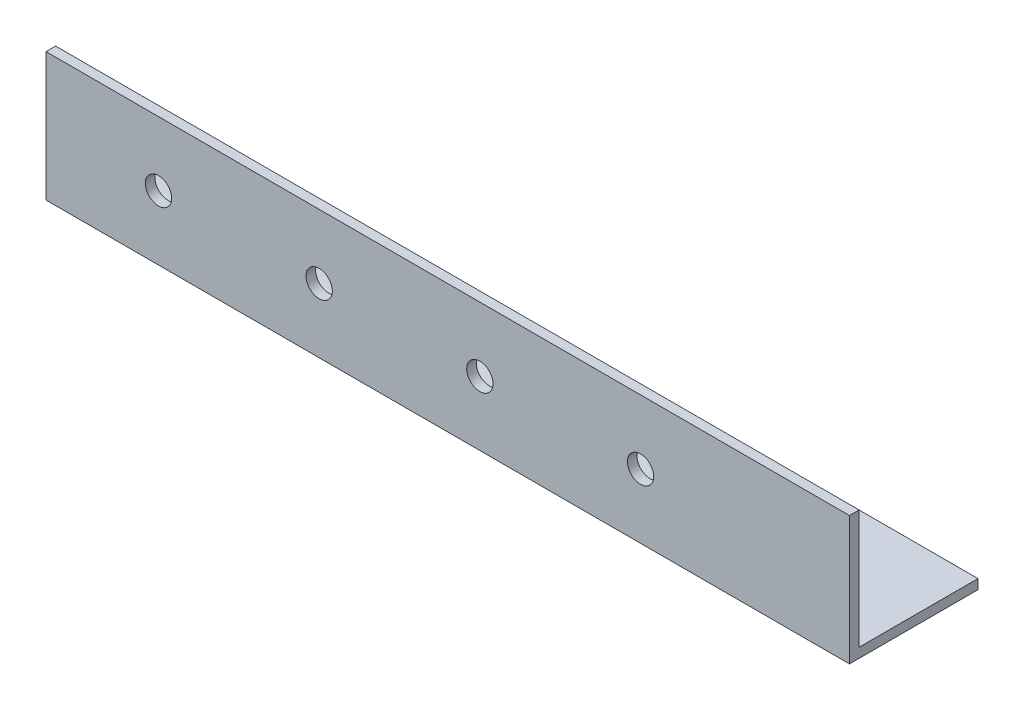
ISO-10303-21;
HEADER;
FILE_DESCRIPTION(('STEP AP214'),'2;1');
FILE_NAME('part.step','',(''),(''),'','','');
FILE_SCHEMA(('AUTOMOTIVE_DESIGN { 1 0 10303 214 1 1 1 1 }'));
ENDSEC;
DATA;
#1=APPLICATION_CONTEXT('core data for automotive mechanical design processes');
#2=APPLICATION_PROTOCOL_DEFINITION('international standard','automotive_design',2000,#1);
#3=PRODUCT_CONTEXT('',#1,'mechanical');
#4=PRODUCT('Part','Part','',(#3));
#5=PRODUCT_RELATED_PRODUCT_CATEGORY('part','',(#4));
#6=PRODUCT_DEFINITION_FORMATION('','',#4);
#7=PRODUCT_DEFINITION_CONTEXT('part definition',#1,'design');
#8=PRODUCT_DEFINITION('design','',#6,#7);
#9=PRODUCT_DEFINITION_SHAPE('','',#8);
#10=(LENGTH_UNIT() NAMED_UNIT(*) SI_UNIT(.MILLI.,.METRE.));
#11=(NAMED_UNIT(*) PLANE_ANGLE_UNIT() SI_UNIT($,.RADIAN.));
#12=(NAMED_UNIT(*) SI_UNIT($,.STERADIAN.) SOLID_ANGLE_UNIT());
#13=UNCERTAINTY_MEASURE_WITH_UNIT(LENGTH_MEASURE(1.E-05),#10,'distance_accuracy_value','');
#14=(GEOMETRIC_REPRESENTATION_CONTEXT(3) GLOBAL_UNCERTAINTY_ASSIGNED_CONTEXT((#13)) GLOBAL_UNIT_ASSIGNED_CONTEXT((#10,
#11,#12)) REPRESENTATION_CONTEXT('',''));
#15=CARTESIAN_POINT('',(0.,0.,0.));
#16=DIRECTION('',(0.,0.,1.));
#17=DIRECTION('',(1.,0.,0.));
#18=AXIS2_PLACEMENT_3D('',#15,#16,#17);
#19=CARTESIAN_POINT('',(250.,0.,0.));
#20=DIRECTION('',(0.,1.,0.));
#21=DIRECTION('',(0.,0.,1.));
#22=AXIS2_PLACEMENT_3D('',#19,#20,#21);
#23=PLANE('',#22);
#24=DIRECTION('',(0.,0.,-1.));
#25=VECTOR('',#24,1.);
#26=CARTESIAN_POINT('',(0.,0.,0.));
#27=LINE('',#26,#25);
#28=CARTESIAN_POINT('',(0.,0.,0.));
#29=VERTEX_POINT('',#28);
#30=CARTESIAN_POINT('',(0.,0.,-40.));
#31=VERTEX_POINT('',#30);
#32=EDGE_CURVE('E118',#29,#31,#27,.T.);
#33=ORIENTED_EDGE('',*,*,#32,.T.);
#34=DIRECTION('',(-1.,0.,0.));
#35=VECTOR('',#34,1.);
#36=CARTESIAN_POINT('',(250.,0.,-40.));
#37=LINE('',#36,#35);
#38=CARTESIAN_POINT('',(250.,0.,-40.));
#39=VERTEX_POINT('',#38);
#40=EDGE_CURVE('E11',#39,#31,#37,.T.);
#41=ORIENTED_EDGE('',*,*,#40,.F.);
#42=DIRECTION('',(0.,0.,-1.));
#43=VECTOR('',#42,1.);
#44=CARTESIAN_POINT('',(250.,0.,0.));
#45=LINE('',#44,#43);
#46=CARTESIAN_POINT('',(250.,0.,0.));
#47=VERTEX_POINT('',#46);
#48=EDGE_CURVE('E83',#47,#39,#45,.T.);
#49=ORIENTED_EDGE('',*,*,#48,.F.);
#50=DIRECTION('',(-1.,0.,0.));
#51=VECTOR('',#50,1.);
#52=CARTESIAN_POINT('',(250.,0.,0.));
#53=LINE('',#52,#51);
#54=EDGE_CURVE('E114',#47,#29,#53,.T.);
#55=ORIENTED_EDGE('',*,*,#54,.T.);
#56=EDGE_LOOP('',(#33,#41,#49,#55));
#57=FACE_BOUND('',#56,.T.);
#58=ADVANCED_FACE('F37',(#57),#23,.F.);
#59=CARTESIAN_POINT('',(250.,3.,-40.));
#60=DIRECTION('',(0.,0.,-1.));
#61=DIRECTION('',(-1.,0.,0.));
#62=AXIS2_PLACEMENT_3D('',#59,#60,#61);
#63=PLANE('',#62);
#64=DIRECTION('',(0.,-1.,0.));
#65=VECTOR('',#64,1.);
#66=CARTESIAN_POINT('',(0.,3.,-40.));
#67=LINE('',#66,#65);
#68=CARTESIAN_POINT('',(0.,3.,-40.));
#69=VERTEX_POINT('',#68);
#70=EDGE_CURVE('E121',#69,#31,#67,.T.);
#71=ORIENTED_EDGE('',*,*,#70,.F.);
#72=DIRECTION('',(-1.,0.,0.));
#73=VECTOR('',#72,1.);
#74=CARTESIAN_POINT('',(250.,3.,-40.));
#75=LINE('',#74,#73);
#76=CARTESIAN_POINT('',(250.,3.,-40.));
#77=VERTEX_POINT('',#76);
#78=EDGE_CURVE('E45',#77,#69,#75,.T.);
#79=ORIENTED_EDGE('',*,*,#78,.F.);
#80=DIRECTION('',(0.,-1.,0.));
#81=VECTOR('',#80,1.);
#82=CARTESIAN_POINT('',(250.,3.,-40.));
#83=LINE('',#82,#81);
#84=EDGE_CURVE('E201',#77,#39,#83,.T.);
#85=ORIENTED_EDGE('',*,*,#84,.T.);
#86=ORIENTED_EDGE('',*,*,#40,.T.);
#87=EDGE_LOOP('',(#71,#79,#85,#86));
#88=FACE_BOUND('',#87,.T.);
#89=ADVANCED_FACE('F140',(#88),#63,.T.);
#90=CARTESIAN_POINT('',(250.,3.,0.));
#91=DIRECTION('',(0.,1.,0.));
#92=DIRECTION('',(0.,0.,1.));
#93=AXIS2_PLACEMENT_3D('',#90,#91,#92);
#94=PLANE('',#93);
#95=DIRECTION('',(0.,0.,-1.));
#96=VECTOR('',#95,1.);
#97=CARTESIAN_POINT('',(0.,3.,0.));
#98=LINE('',#97,#96);
#99=CARTESIAN_POINT('',(0.,3.,-3.));
#100=VERTEX_POINT('',#99);
#101=EDGE_CURVE('E125',#100,#69,#98,.T.);
#102=ORIENTED_EDGE('',*,*,#101,.F.);
#103=DIRECTION('',(-1.,0.,0.));
#104=VECTOR('',#103,1.);
#105=CARTESIAN_POINT('',(250.,3.,-3.));
#106=LINE('',#105,#104);
#107=CARTESIAN_POINT('',(250.,3.,-3.));
#108=VERTEX_POINT('',#107);
#109=EDGE_CURVE('E104',#108,#100,#106,.T.);
#110=ORIENTED_EDGE('',*,*,#109,.F.);
#111=DIRECTION('',(0.,0.,-1.));
#112=VECTOR('',#111,1.);
#113=CARTESIAN_POINT('',(250.,3.,0.));
#114=LINE('',#113,#112);
#115=EDGE_CURVE('E110',#108,#77,#114,.T.);
#116=ORIENTED_EDGE('',*,*,#115,.T.);
#117=ORIENTED_EDGE('',*,*,#78,.T.);
#118=EDGE_LOOP('',(#102,#110,#116,#117));
#119=FACE_BOUND('',#118,.T.);
#120=ADVANCED_FACE('F137',(#119),#94,.T.);
#121=CARTESIAN_POINT('',(250.,0.,-3.));
#122=DIRECTION('',(0.,0.,-1.));
#123=DIRECTION('',(-1.,0.,0.));
#124=AXIS2_PLACEMENT_3D('',#121,#122,#123);
#125=PLANE('',#124);
#126=CARTESIAN_POINT('',(35.,20.0000000000001,-3.));
#127=DIRECTION('',(0.,0.,-1.));
#128=DIRECTION('',(-1.,0.,0.));
#129=AXIS2_PLACEMENT_3D('',#126,#127,#128);
#130=CIRCLE('',#129,4.1);
#131=CARTESIAN_POINT('',(30.9,20.0000000000001,-3.));
#132=VERTEX_POINT('',#131);
#133=EDGE_CURVE('E122',#132,#132,#130,.T.);
#134=ORIENTED_EDGE('',*,*,#133,.F.);
#135=EDGE_LOOP('',(#134));
#136=FACE_BOUND('',#135,.T.);
#137=CARTESIAN_POINT('',(85.,20.0000000000001,-3.));
#138=DIRECTION('',(0.,0.,-1.));
#139=DIRECTION('',(-1.,0.,0.));
#140=AXIS2_PLACEMENT_3D('',#137,#138,#139);
#141=CIRCLE('',#140,4.1);
#142=CARTESIAN_POINT('',(80.9,20.0000000000001,-3.));
#143=VERTEX_POINT('',#142);
#144=EDGE_CURVE('E179',#143,#143,#141,.T.);
#145=ORIENTED_EDGE('',*,*,#144,.F.);
#146=EDGE_LOOP('',(#145));
#147=FACE_BOUND('',#146,.T.);
#148=CARTESIAN_POINT('',(135.,20.0000000000001,-3.));
#149=DIRECTION('',(0.,0.,-1.));
#150=DIRECTION('',(-1.,0.,0.));
#151=AXIS2_PLACEMENT_3D('',#148,#149,#150);
#152=CIRCLE('',#151,4.09999999999999);
#153=CARTESIAN_POINT('',(130.9,20.0000000000001,-3.));
#154=VERTEX_POINT('',#153);
#155=EDGE_CURVE('E183',#154,#154,#152,.T.);
#156=ORIENTED_EDGE('',*,*,#155,.F.);
#157=EDGE_LOOP('',(#156));
#158=FACE_BOUND('',#157,.T.);
#159=CARTESIAN_POINT('',(185.,20.0000000000001,-3.));
#160=DIRECTION('',(0.,0.,-1.));
#161=DIRECTION('',(-1.,0.,0.));
#162=AXIS2_PLACEMENT_3D('',#159,#160,#161);
#163=CIRCLE('',#162,4.10000000000001);
#164=CARTESIAN_POINT('',(180.9,20.0000000000001,-3.));
#165=VERTEX_POINT('',#164);
#166=EDGE_CURVE('E186',#165,#165,#163,.T.);
#167=ORIENTED_EDGE('',*,*,#166,.F.);
#168=EDGE_LOOP('',(#167));
#169=FACE_BOUND('',#168,.T.);
#170=DIRECTION('',(0.,1.,0.));
#171=VECTOR('',#170,1.);
#172=CARTESIAN_POINT('',(0.,0.,-3.));
#173=LINE('',#172,#171);
#174=CARTESIAN_POINT('',(0.,40.,-3.));
#175=VERTEX_POINT('',#174);
#176=EDGE_CURVE('E99',#175,#100,#173,.F.);
#177=ORIENTED_EDGE('',*,*,#176,.F.);
#178=DIRECTION('',(-1.,0.,0.));
#179=VECTOR('',#178,1.);
#180=CARTESIAN_POINT('',(250.,40.,-3.));
#181=LINE('',#180,#179);
#182=CARTESIAN_POINT('',(250.,40.,-3.));
#183=VERTEX_POINT('',#182);
#184=EDGE_CURVE('E94',#183,#175,#181,.T.);
#185=ORIENTED_EDGE('',*,*,#184,.F.);
#186=DIRECTION('',(0.,1.,0.));
#187=VECTOR('',#186,1.);
#188=CARTESIAN_POINT('',(250.,0.,-3.));
#189=LINE('',#188,#187);
#190=EDGE_CURVE('E97',#183,#108,#189,.F.);
#191=ORIENTED_EDGE('',*,*,#190,.T.);
#192=ORIENTED_EDGE('',*,*,#109,.T.);
#193=EDGE_LOOP('',(#177,#185,#191,#192));
#194=FACE_BOUND('',#193,.T.);
#195=ADVANCED_FACE('F96',(#136,#147,#158,#169,#194),#125,.T.);
#196=CARTESIAN_POINT('',(250.,40.,0.));
#197=DIRECTION('',(0.,1.,0.));
#198=DIRECTION('',(0.,0.,1.));
#199=AXIS2_PLACEMENT_3D('',#196,#197,#198);
#200=PLANE('',#199);
#201=DIRECTION('',(0.,0.,-1.));
#202=VECTOR('',#201,1.);
#203=CARTESIAN_POINT('',(0.,40.,0.));
#204=LINE('',#203,#202);
#205=CARTESIAN_POINT('',(0.,40.,0.));
#206=VERTEX_POINT('',#205);
#207=EDGE_CURVE('E129',#206,#175,#204,.T.);
#208=ORIENTED_EDGE('',*,*,#207,.F.);
#209=DIRECTION('',(-1.,0.,0.));
#210=VECTOR('',#209,1.);
#211=CARTESIAN_POINT('',(250.,40.,0.));
#212=LINE('',#211,#210);
#213=CARTESIAN_POINT('',(250.,40.,0.));
#214=VERTEX_POINT('',#213);
#215=EDGE_CURVE('E74',#214,#206,#212,.T.);
#216=ORIENTED_EDGE('',*,*,#215,.F.);
#217=DIRECTION('',(0.,0.,-1.));
#218=VECTOR('',#217,1.);
#219=CARTESIAN_POINT('',(250.,40.,0.));
#220=LINE('',#219,#218);
#221=EDGE_CURVE('E108',#214,#183,#220,.T.);
#222=ORIENTED_EDGE('',*,*,#221,.T.);
#223=ORIENTED_EDGE('',*,*,#184,.T.);
#224=EDGE_LOOP('',(#208,#216,#222,#223));
#225=FACE_BOUND('',#224,.T.);
#226=ADVANCED_FACE('F112',(#225),#200,.T.);
#227=CARTESIAN_POINT('',(250.,0.,0.));
#228=DIRECTION('',(0.,0.,-1.));
#229=DIRECTION('',(-1.,0.,0.));
#230=AXIS2_PLACEMENT_3D('',#227,#228,#229);
#231=PLANE('',#230);
#232=CARTESIAN_POINT('',(35.,20.0000000000001,0.));
#233=DIRECTION('',(0.,0.,1.));
#234=DIRECTION('',(1.,0.,0.));
#235=AXIS2_PLACEMENT_3D('',#232,#233,#234);
#236=CIRCLE('',#235,4.1);
#237=CARTESIAN_POINT('',(39.1,20.0000000000001,0.));
#238=VERTEX_POINT('',#237);
#239=EDGE_CURVE('E188',#238,#238,#236,.T.);
#240=ORIENTED_EDGE('',*,*,#239,.F.);
#241=EDGE_LOOP('',(#240));
#242=FACE_BOUND('',#241,.T.);
#243=CARTESIAN_POINT('',(85.,20.0000000000001,0.));
#244=DIRECTION('',(0.,0.,1.));
#245=DIRECTION('',(1.,0.,0.));
#246=AXIS2_PLACEMENT_3D('',#243,#244,#245);
#247=CIRCLE('',#246,4.1);
#248=CARTESIAN_POINT('',(89.1,20.0000000000001,0.));
#249=VERTEX_POINT('',#248);
#250=EDGE_CURVE('E192',#249,#249,#247,.T.);
#251=ORIENTED_EDGE('',*,*,#250,.F.);
#252=EDGE_LOOP('',(#251));
#253=FACE_BOUND('',#252,.T.);
#254=CARTESIAN_POINT('',(135.,20.0000000000001,0.));
#255=DIRECTION('',(0.,0.,1.));
#256=DIRECTION('',(1.,0.,0.));
#257=AXIS2_PLACEMENT_3D('',#254,#255,#256);
#258=CIRCLE('',#257,4.09999999999999);
#259=CARTESIAN_POINT('',(139.1,20.0000000000001,0.));
#260=VERTEX_POINT('',#259);
#261=EDGE_CURVE('E309',#260,#260,#258,.T.);
#262=ORIENTED_EDGE('',*,*,#261,.F.);
#263=EDGE_LOOP('',(#262));
#264=FACE_BOUND('',#263,.T.);
#265=CARTESIAN_POINT('',(185.,20.0000000000001,0.));
#266=DIRECTION('',(0.,0.,1.));
#267=DIRECTION('',(1.,0.,0.));
#268=AXIS2_PLACEMENT_3D('',#265,#266,#267);
#269=CIRCLE('',#268,4.10000000000001);
#270=CARTESIAN_POINT('',(189.1,20.0000000000001,0.));
#271=VERTEX_POINT('',#270);
#272=EDGE_CURVE('E195',#271,#271,#269,.T.);
#273=ORIENTED_EDGE('',*,*,#272,.F.);
#274=EDGE_LOOP('',(#273));
#275=FACE_BOUND('',#274,.T.);
#276=DIRECTION('',(0.,-1.,0.));
#277=VECTOR('',#276,1.);
#278=CARTESIAN_POINT('',(0.,0.,0.));
#279=LINE('',#278,#277);
#280=EDGE_CURVE('E77',#206,#29,#279,.T.);
#281=ORIENTED_EDGE('',*,*,#280,.T.);
#282=ORIENTED_EDGE('',*,*,#54,.F.);
#283=DIRECTION('',(0.,-1.,0.));
#284=VECTOR('',#283,1.);
#285=CARTESIAN_POINT('',(250.,0.,0.));
#286=LINE('',#285,#284);
#287=EDGE_CURVE('E53',#214,#47,#286,.T.);
#288=ORIENTED_EDGE('',*,*,#287,.F.);
#289=ORIENTED_EDGE('',*,*,#215,.T.);
#290=EDGE_LOOP('',(#281,#282,#288,#289));
#291=FACE_BOUND('',#290,.T.);
#292=ADVANCED_FACE('F145',(#242,#253,#264,#275,#291),#231,.F.);
#293=CARTESIAN_POINT('',(250.,0.,0.));
#294=DIRECTION('',(-1.,0.,0.));
#295=DIRECTION('',(0.,0.,1.));
#296=AXIS2_PLACEMENT_3D('',#293,#294,#295);
#297=PLANE('',#296);
#298=ORIENTED_EDGE('',*,*,#48,.T.);
#299=ORIENTED_EDGE('',*,*,#84,.F.);
#300=ORIENTED_EDGE('',*,*,#115,.F.);
#301=ORIENTED_EDGE('',*,*,#190,.F.);
#302=ORIENTED_EDGE('',*,*,#221,.F.);
#303=ORIENTED_EDGE('',*,*,#287,.T.);
#304=EDGE_LOOP('',(#298,#299,#300,#301,#302,#303));
#305=FACE_BOUND('',#304,.T.);
#306=ADVANCED_FACE('F107',(#305),#297,.F.);
#307=CARTESIAN_POINT('',(0.,0.,0.));
#308=DIRECTION('',(-1.,0.,0.));
#309=DIRECTION('',(0.,0.,1.));
#310=AXIS2_PLACEMENT_3D('',#307,#308,#309);
#311=PLANE('',#310);
#312=ORIENTED_EDGE('',*,*,#32,.F.);
#313=ORIENTED_EDGE('',*,*,#280,.F.);
#314=ORIENTED_EDGE('',*,*,#207,.T.);
#315=ORIENTED_EDGE('',*,*,#176,.T.);
#316=ORIENTED_EDGE('',*,*,#101,.T.);
#317=ORIENTED_EDGE('',*,*,#70,.T.);
#318=EDGE_LOOP('',(#312,#313,#314,#315,#316,#317));
#319=FACE_BOUND('',#318,.T.);
#320=ADVANCED_FACE('F143',(#319),#311,.T.);
#321=CARTESIAN_POINT('',(185.,20.0000000000001,-10.));
#322=DIRECTION('',(0.,0.,1.));
#323=DIRECTION('',(1.,0.,0.));
#324=AXIS2_PLACEMENT_3D('',#321,#322,#323);
#325=CYLINDRICAL_SURFACE('',#324,4.10000000000001);
#326=ORIENTED_EDGE('',*,*,#166,.T.);
#327=EDGE_LOOP('',(#326));
#328=FACE_BOUND('',#327,.T.);
#329=ORIENTED_EDGE('',*,*,#272,.T.);
#330=EDGE_LOOP('',(#329));
#331=FACE_BOUND('',#330,.T.);
#332=ADVANCED_FACE('F217',(#328,#331),#325,.F.);
#333=CARTESIAN_POINT('',(135.,20.0000000000001,-10.));
#334=DIRECTION('',(0.,0.,1.));
#335=DIRECTION('',(1.,0.,0.));
#336=AXIS2_PLACEMENT_3D('',#333,#334,#335);
#337=CYLINDRICAL_SURFACE('',#336,4.09999999999999);
#338=ORIENTED_EDGE('',*,*,#155,.T.);
#339=EDGE_LOOP('',(#338));
#340=FACE_BOUND('',#339,.T.);
#341=ORIENTED_EDGE('',*,*,#261,.T.);
#342=EDGE_LOOP('',(#341));
#343=FACE_BOUND('',#342,.T.);
#344=ADVANCED_FACE('F211',(#340,#343),#337,.F.);
#345=CARTESIAN_POINT('',(85.,20.0000000000001,-10.));
#346=DIRECTION('',(0.,0.,1.));
#347=DIRECTION('',(1.,0.,0.));
#348=AXIS2_PLACEMENT_3D('',#345,#346,#347);
#349=CYLINDRICAL_SURFACE('',#348,4.1);
#350=ORIENTED_EDGE('',*,*,#144,.T.);
#351=EDGE_LOOP('',(#350));
#352=FACE_BOUND('',#351,.T.);
#353=ORIENTED_EDGE('',*,*,#250,.T.);
#354=EDGE_LOOP('',(#353));
#355=FACE_BOUND('',#354,.T.);
#356=ADVANCED_FACE('F206',(#352,#355),#349,.F.);
#357=CARTESIAN_POINT('',(35.,20.0000000000001,-10.));
#358=DIRECTION('',(0.,0.,1.));
#359=DIRECTION('',(1.,0.,0.));
#360=AXIS2_PLACEMENT_3D('',#357,#358,#359);
#361=CYLINDRICAL_SURFACE('',#360,4.1);
#362=ORIENTED_EDGE('',*,*,#133,.T.);
#363=EDGE_LOOP('',(#362));
#364=FACE_BOUND('',#363,.T.);
#365=ORIENTED_EDGE('',*,*,#239,.T.);
#366=EDGE_LOOP('',(#365));
#367=FACE_BOUND('',#366,.T.);
#368=ADVANCED_FACE('F203',(#364,#367),#361,.F.);
#369=CLOSED_SHELL('',(#58,#89,#120,#195,#226,#292,#306,#320,#332,#344,#356,#368));
#370=MANIFOLD_SOLID_BREP('B2',#369);
#371=ADVANCED_BREP_SHAPE_REPRESENTATION('',(#18,#370),#14);
#372=SHAPE_DEFINITION_REPRESENTATION(#9,#371);
ENDSEC;
END-ISO-10303-21;
